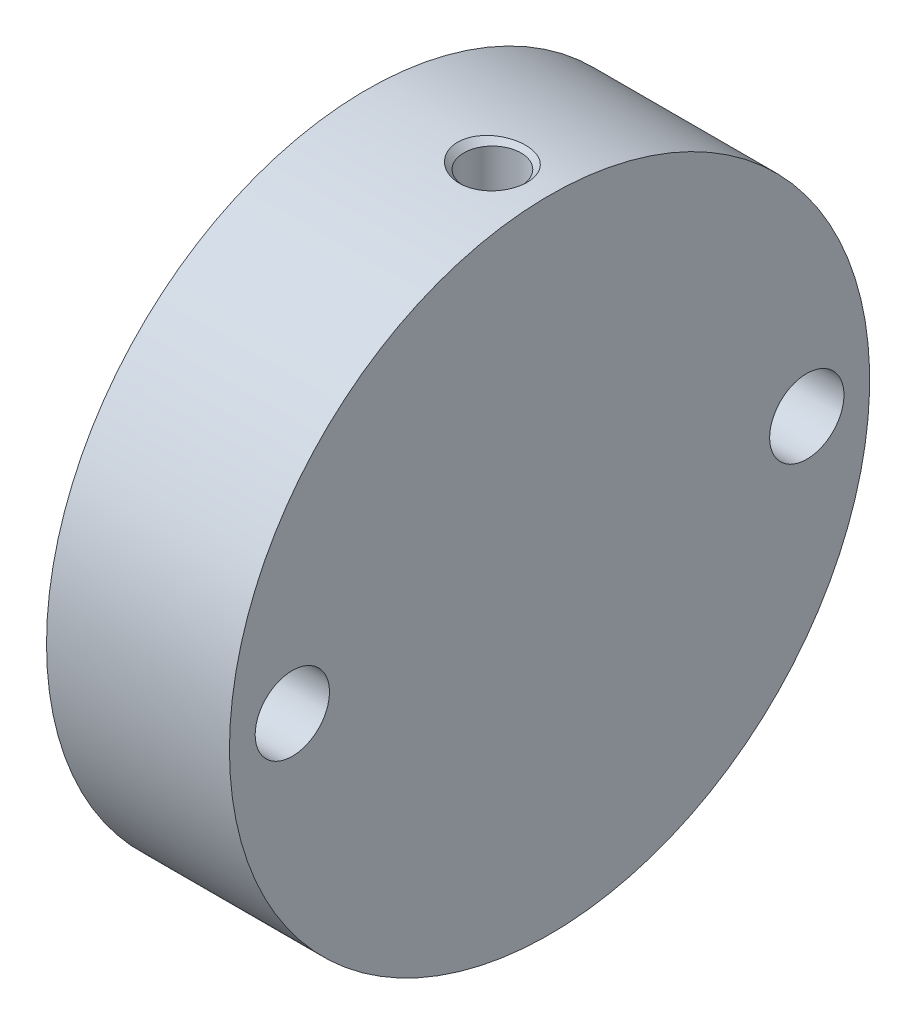
ISO-10303-21;
HEADER;
FILE_DESCRIPTION(('STEP AP214'),'2;1');
FILE_NAME('part.step','',(''),(''),'','','');
FILE_SCHEMA(('AUTOMOTIVE_DESIGN { 1 0 10303 214 1 1 1 1 }'));
ENDSEC;
DATA;
#1=APPLICATION_CONTEXT('core data for automotive mechanical design processes');
#2=APPLICATION_PROTOCOL_DEFINITION('international standard','automotive_design',2000,#1);
#3=PRODUCT_CONTEXT('',#1,'mechanical');
#4=PRODUCT('Part','Part','',(#3));
#5=PRODUCT_RELATED_PRODUCT_CATEGORY('part','',(#4));
#6=PRODUCT_DEFINITION_FORMATION('','',#4);
#7=PRODUCT_DEFINITION_CONTEXT('part definition',#1,'design');
#8=PRODUCT_DEFINITION('design','',#6,#7);
#9=PRODUCT_DEFINITION_SHAPE('','',#8);
#10=(LENGTH_UNIT() NAMED_UNIT(*) SI_UNIT(.MILLI.,.METRE.));
#11=(NAMED_UNIT(*) PLANE_ANGLE_UNIT() SI_UNIT($,.RADIAN.));
#12=(NAMED_UNIT(*) SI_UNIT($,.STERADIAN.) SOLID_ANGLE_UNIT());
#13=UNCERTAINTY_MEASURE_WITH_UNIT(LENGTH_MEASURE(1.E-05),#10,'distance_accuracy_value','');
#14=(GEOMETRIC_REPRESENTATION_CONTEXT(3) GLOBAL_UNCERTAINTY_ASSIGNED_CONTEXT((#13)) GLOBAL_UNIT_ASSIGNED_CONTEXT((#10,
#11,#12)) REPRESENTATION_CONTEXT('',''));
#15=CARTESIAN_POINT('',(0.,0.,0.));
#16=DIRECTION('',(0.,0.,1.));
#17=DIRECTION('',(1.,0.,0.));
#18=AXIS2_PLACEMENT_3D('',#15,#16,#17);
#19=CARTESIAN_POINT('',(9.69645,0.,0.));
#20=DIRECTION('',(1.,0.,0.));
#21=DIRECTION('',(0.,0.,-1.));
#22=AXIS2_PLACEMENT_3D('',#19,#20,#21);
#23=PLANE('',#22);
#24=CARTESIAN_POINT('',(9.69645,0.,0.));
#25=DIRECTION('',(-1.,0.,0.));
#26=DIRECTION('',(0.,0.,1.));
#27=AXIS2_PLACEMENT_3D('',#24,#25,#26);
#28=CIRCLE('',#27,9.652);
#29=CARTESIAN_POINT('',(9.69645,0.,9.652));
#30=VERTEX_POINT('',#29);
#31=EDGE_CURVE('E89',#30,#30,#28,.T.);
#32=ORIENTED_EDGE('',*,*,#31,.T.);
#33=EDGE_LOOP('',(#32));
#34=FACE_BOUND('',#33,.T.);
#35=ADVANCED_FACE('F15',(#34),#23,.F.);
#36=CARTESIAN_POINT('',(8.73125,8.89,0.));
#37=DIRECTION('',(0.,1.,0.));
#38=DIRECTION('',(0.,0.,1.));
#39=AXIS2_PLACEMENT_3D('',#36,#37,#38);
#40=CYLINDRICAL_SURFACE('',#39,0.482600000000003);
#41=CARTESIAN_POINT('',(8.73125,15.8523162872939,0.));
#42=DIRECTION('',(0.,1.,0.));
#43=DIRECTION('',(0.,0.,1.));
#44=AXIS2_PLACEMENT_3D('',#41,#42,#43);
#45=CIRCLE('',#44,0.482599999998001);
#46=CARTESIAN_POINT('',(8.73125,15.8523162872939,0.482599999998001));
#47=VERTEX_POINT('',#46);
#48=EDGE_CURVE('E88',#47,#47,#45,.T.);
#49=ORIENTED_EDGE('',*,*,#48,.T.);
#50=EDGE_LOOP('',(#49));
#51=FACE_BOUND('',#50,.T.);
#52=CARTESIAN_POINT('',(8.82691178443201,9.64040208793173,-0.473023871496162));
#53=CARTESIAN_POINT('',(8.853478600334,9.64066585059454,-0.467649923057808));
#54=CARTESIAN_POINT('',(8.8796096214966,9.64103593029908,-0.460029012636091));
#55=CARTESIAN_POINT('',(8.93024028657117,9.64194768011579,-0.440503654337834));
#56=CARTESIAN_POINT('',(8.95473795414603,9.64248955369429,-0.428594124895926));
#57=CARTESIAN_POINT('',(9.00137407481033,9.64368315618617,-0.400838334919282));
#58=CARTESIAN_POINT('',(9.02351372980269,9.64433482869233,-0.384994093801457));
#59=CARTESIAN_POINT('',(9.06481347513031,9.64567462311919,-0.349819725848855));
#60=CARTESIAN_POINT('',(9.08397428043544,9.64636273624027,-0.330490437891987));
#61=CARTESIAN_POINT('',(9.11879495043228,9.64769861674467,-0.288874160856062));
#62=CARTESIAN_POINT('',(9.13445215619088,9.64834635321842,-0.266584945747979));
#63=CARTESIAN_POINT('',(9.16180271790883,9.64952793776097,-0.219690541929899));
#64=CARTESIAN_POINT('',(9.17349593314582,9.65006178178631,-0.19508527103912));
#65=CARTESIAN_POINT('',(9.19258104141403,9.65095519425309,-0.144266598186337));
#66=CARTESIAN_POINT('',(9.19997448231819,9.6513148254015,-0.118053778685912));
#67=CARTESIAN_POINT('',(9.21025505155551,9.65181953742723,-0.064756972157018));
#68=CARTESIAN_POINT('',(9.21314222208857,9.65196462031371,-0.0376729932891269));
#69=CARTESIAN_POINT('',(9.21432695079284,9.65202383970858,0.0165652629517799));
#70=CARTESIAN_POINT('',(9.21262959300494,9.65193823204291,0.0437194291187682));
#71=CARTESIAN_POINT('',(9.20470472231245,9.65154625987542,0.0973566861254278));
#72=CARTESIAN_POINT('',(9.19847722176638,9.65123989597582,0.123839778795627));
#73=CARTESIAN_POINT('',(9.18167118470258,9.65044095201613,0.175379943345877));
#74=CARTESIAN_POINT('',(9.17109328549389,9.64994839923251,0.200437223487676));
#75=CARTESIAN_POINT('',(9.14588732778346,9.64883244512944,0.248421241435725));
#76=CARTESIAN_POINT('',(9.13125923608947,9.64820904273764,0.271347961779493));
#77=CARTESIAN_POINT('',(9.09835006336523,9.64690074287379,0.314445827438008));
#78=CARTESIAN_POINT('',(9.08006518175844,9.64621578183382,0.334614068777294));
#79=CARTESIAN_POINT('',(9.04036962709465,9.64486203080492,0.371596117569157));
#80=CARTESIAN_POINT('',(9.01895894240953,9.64419324087615,0.388409912542496));
#81=CARTESIAN_POINT('',(8.97360348514573,9.64294680470675,0.418215690297399));
#82=CARTESIAN_POINT('',(8.94965717483509,9.64236921430915,0.431205335662262));
#83=CARTESIAN_POINT('',(8.89992027573722,9.64137092897452,0.452979083595711));
#84=CARTESIAN_POINT('',(8.87412969673885,9.64095023320482,0.461763208484107));
#85=CARTESIAN_POINT('',(8.82145757958168,9.64031359044806,0.474869783709755));
#86=CARTESIAN_POINT('',(8.79457690633107,9.64009748432522,0.479195702002364));
#87=CARTESIAN_POINT('',(8.74047004823061,9.63989390627959,0.483274027071729));
#88=CARTESIAN_POINT('',(8.71324386562981,9.63990643286931,0.483026463603775));
#89=CARTESIAN_POINT('',(8.65924628820372,9.64015857563368,0.477967432445839));
#90=CARTESIAN_POINT('',(8.63247448477103,9.64039797542472,0.473160313494383));
#91=CARTESIAN_POINT('',(8.58011840734985,9.64107651496723,0.459125842914443));
#92=CARTESIAN_POINT('',(8.55453413646129,9.64151565524007,0.449898479748042));
#93=CARTESIAN_POINT('',(8.50526854812146,9.64254434485509,0.42728218137894));
#94=CARTESIAN_POINT('',(8.48158792137832,9.64313394846957,0.413891744169473));
#95=CARTESIAN_POINT('',(8.43680917385624,9.64439707371412,0.383330350999746));
#96=CARTESIAN_POINT('',(8.41571107227039,9.64507059596778,0.36615936694547));
#97=CARTESIAN_POINT('',(8.37667161768533,9.64642655087874,0.328501580331402));
#98=CARTESIAN_POINT('',(8.3587337979044,9.64710899260422,0.308011115062328));
#99=CARTESIAN_POINT('',(8.32655201238646,9.64840517149789,0.26430797715352));
#100=CARTESIAN_POINT('',(8.31230805104865,9.64901890858425,0.241095301271824));
#101=CARTESIAN_POINT('',(8.28791723673742,9.65010860120586,0.192602013322742));
#102=CARTESIAN_POINT('',(8.27777091061991,9.65058453902125,0.167321135837307));
#103=CARTESIAN_POINT('',(8.26186772200809,9.65134484805023,0.115411841744874));
#104=CARTESIAN_POINT('',(8.25611082307998,9.65162922085389,0.0887834363247943));
#105=CARTESIAN_POINT('',(8.24915494399501,9.65197413025986,0.0349649540769365));
#106=CARTESIAN_POINT('',(8.24795117102673,9.65203490223197,0.00777549817504966));
#107=CARTESIAN_POINT('',(8.25012273719345,9.65192641783152,-0.0464194303550292));
#108=CARTESIAN_POINT('',(8.2534980665029,9.65175716195254,-0.0734249033778749));
#109=CARTESIAN_POINT('',(8.26472784491088,9.65120785676751,-0.126468783044584));
#110=CARTESIAN_POINT('',(8.27257963925145,9.65082793240161,-0.152507753131129));
#111=CARTESIAN_POINT('',(8.29253654783662,9.64990010225596,-0.202898116718834));
#112=CARTESIAN_POINT('',(8.30464169314435,9.6493521952494,-0.22724949789362));
#113=CARTESIAN_POINT('',(8.33277300103818,9.64814947525204,-0.273595067428044));
#114=CARTESIAN_POINT('',(8.3488023286792,9.64749457610912,-0.295587332343971));
#115=CARTESIAN_POINT('',(8.38432221281501,9.64615187862034,-0.336569673889902));
#116=CARTESIAN_POINT('',(8.40381265955754,9.64546408131818,-0.355559845680353));
#117=CARTESIAN_POINT('',(8.44572157523306,9.64413238906976,-0.390016449041162));
#118=CARTESIAN_POINT('',(8.46814248704221,9.64348853144149,-0.405479910843984));
#119=CARTESIAN_POINT('',(8.5152713392436,9.64231786918307,-0.432426693819606));
#120=CARTESIAN_POINT('',(8.53997982756004,9.64179109269966,-0.443909058291997));
#121=CARTESIAN_POINT('',(8.59097699729467,9.64091426305894,-0.462562211567225));
#122=CARTESIAN_POINT('',(8.61726582318488,9.64056422608644,-0.469732605515006));
#123=CARTESIAN_POINT('',(8.67065502584937,9.64008106503623,-0.479547733988183));
#124=CARTESIAN_POINT('',(8.69775440251679,9.63994768403647,-0.482197829108715));
#125=CARTESIAN_POINT('',(8.74198280371538,9.63991812368235,-0.482785022734862));
#126=CARTESIAN_POINT('',(8.75910520366269,9.63995263632657,-0.482099222662507));
#127=CARTESIAN_POINT('',(8.79318027400602,9.64011132604314,-0.478915661717446));
#128=CARTESIAN_POINT('',(8.81013294463839,9.64023550299062,-0.476417903368066));
#129=CARTESIAN_POINT('',(8.82691178443201,9.64040208793173,-0.473023871496162));
#130=B_SPLINE_CURVE_WITH_KNOTS('',3,(#52,#53,#54,#55,#56,#57,#58,#59,#60,#61,#62,#63,#64,#65,
#66,#67,#68,#69,#70,#71,#72,#73,#74,#75,#76,#77,#78,#79,#80,#81,#82,#83,#84,#85,#86,#87,#88,#89,
#90,#91,#92,#93,#94,#95,#96,#97,#98,#99,#100,#101,#102,#103,#104,#105,#106,#107,#108,#109,#110,
#111,#112,#113,#114,#115,#116,#117,#118,#119,#120,#121,#122,#123,#124,#125,#126,#127,#128,#129),
.UNSPECIFIED.,.T.,.F.,(4,2,2,2,2,2,2,2,2,2,2,2,2,2,2,2,2,2,2,2,2,2,2,2,2,2,2,2,2,2,2,2,2,2,2,2,
2,2,4),(0.,0.0812559962180522,0.162608590826617,0.24391951872121,0.325210900508895,
0.406563767849222,0.487919522928426,0.569245972644902,0.650571660758367,0.731807199288603,
0.813042516203921,0.89426593683702,0.97549002313434,1.05679897014646,1.13810821963909,
1.21946706470236,1.30082547796794,1.38212055616991,1.46341510546241,1.54463219684813,
1.62584950023147,1.70709614029781,1.78834338414492,1.86968089440943,1.95101850154216,
2.03236656337952,2.11371394999167,2.19497568306213,2.27623724176666,2.3574506585341,
2.43866466843266,2.51994439866969,2.60122155198234,2.6825668964131,2.76393177547603,
2.8453041041362,2.9265798665781,2.97789889729985,3.02921785655503),.UNSPECIFIED.);
#131=CARTESIAN_POINT('',(8.82691178443201,9.64040208793173,-0.473023871496162));
#132=VERTEX_POINT('',#131);
#133=EDGE_CURVE('E18',#132,#132,#130,.T.);
#134=ORIENTED_EDGE('',*,*,#133,.T.);
#135=EDGE_LOOP('',(#134));
#136=FACE_BOUND('',#135,.T.);
#137=ADVANCED_FACE('F97',(#51,#136),#40,.F.);
#138=CARTESIAN_POINT('',(12.7,0.,0.));
#139=DIRECTION('',(-1.,0.,0.));
#140=DIRECTION('',(0.,0.,1.));
#141=AXIS2_PLACEMENT_3D('',#138,#139,#140);
#142=CYLINDRICAL_SURFACE('',#141,9.652);
#143=ORIENTED_EDGE('',*,*,#31,.F.);
#144=EDGE_LOOP('',(#143));
#145=FACE_BOUND('',#144,.T.);
#146=ORIENTED_EDGE('',*,*,#133,.F.);
#147=EDGE_LOOP('',(#146));
#148=FACE_BOUND('',#147,.T.);
#149=CARTESIAN_POINT('',(7.76605,0.,0.));
#150=DIRECTION('',(-1.,0.,0.));
#151=DIRECTION('',(0.,0.,1.));
#152=AXIS2_PLACEMENT_3D('',#149,#150,#151);
#153=CIRCLE('',#152,9.652);
#154=CARTESIAN_POINT('',(7.76605,0.,9.652));
#155=VERTEX_POINT('',#154);
#156=EDGE_CURVE('E86',#155,#155,#153,.T.);
#157=ORIENTED_EDGE('',*,*,#156,.T.);
#158=EDGE_LOOP('',(#157));
#159=FACE_BOUND('',#158,.T.);
#160=ADVANCED_FACE('F99',(#145,#148,#159),#142,.F.);
#161=CARTESIAN_POINT('',(8.73125,16.7189998703634,0.));
#162=DIRECTION('',(0.,1.,0.));
#163=DIRECTION('',(0.,0.,1.));
#164=AXIS2_PLACEMENT_3D('',#161,#162,#163);
#165=CONICAL_SURFACE('',#164,1.98373999995738,1.04719755119577);
#166=CARTESIAN_POINT('',(8.73125,16.718999870343,0.));
#167=DIRECTION('',(0.,1.,0.));
#168=DIRECTION('',(0.,0.,1.));
#169=AXIS2_PLACEMENT_3D('',#166,#167,#168);
#170=CIRCLE('',#169,1.98374);
#171=CARTESIAN_POINT('',(8.73125,16.718999870343,1.98374));
#172=VERTEX_POINT('',#171);
#173=EDGE_CURVE('E85',#172,#172,#170,.T.);
#174=ORIENTED_EDGE('',*,*,#173,.T.);
#175=EDGE_LOOP('',(#174));
#176=FACE_BOUND('',#175,.T.);
#177=ORIENTED_EDGE('',*,*,#48,.F.);
#178=EDGE_LOOP('',(#177));
#179=FACE_BOUND('',#178,.T.);
#180=ADVANCED_FACE('F102',(#176,#179),#165,.F.);
#181=CARTESIAN_POINT('',(7.76605,9.652,0.));
#182=DIRECTION('',(1.,0.,0.));
#183=DIRECTION('',(0.,0.,-1.));
#184=AXIS2_PLACEMENT_3D('',#181,#182,#183);
#185=PLANE('',#184);
#186=ORIENTED_EDGE('',*,*,#156,.F.);
#187=EDGE_LOOP('',(#186));
#188=FACE_BOUND('',#187,.T.);
#189=CARTESIAN_POINT('',(7.76605,0.,0.));
#190=DIRECTION('',(-1.,0.,0.));
#191=DIRECTION('',(0.,0.,1.));
#192=AXIS2_PLACEMENT_3D('',#189,#190,#191);
#193=CIRCLE('',#192,12.7);
#194=CARTESIAN_POINT('',(7.76605,0.,12.7));
#195=VERTEX_POINT('',#194);
#196=EDGE_CURVE('E82',#195,#195,#193,.T.);
#197=ORIENTED_EDGE('',*,*,#196,.T.);
#198=EDGE_LOOP('',(#197));
#199=FACE_BOUND('',#198,.T.);
#200=ADVANCED_FACE('F106',(#188,#199),#185,.F.);
#201=CARTESIAN_POINT('',(8.73125,8.89,0.));
#202=DIRECTION('',(0.,1.,0.));
#203=DIRECTION('',(0.,0.,1.));
#204=AXIS2_PLACEMENT_3D('',#201,#202,#203);
#205=CYLINDRICAL_SURFACE('',#204,1.98374);
#206=CARTESIAN_POINT('',(8.73125,21.7957399999591,0.));
#207=DIRECTION('',(0.,1.,0.));
#208=DIRECTION('',(0.,0.,1.));
#209=AXIS2_PLACEMENT_3D('',#206,#207,#208);
#210=CIRCLE('',#209,1.98374000001422);
#211=CARTESIAN_POINT('',(8.73125,21.7957399999591,1.98374000001422));
#212=VERTEX_POINT('',#211);
#213=EDGE_CURVE('E70',#212,#212,#210,.T.);
#214=ORIENTED_EDGE('',*,*,#213,.T.);
#215=EDGE_LOOP('',(#214));
#216=FACE_BOUND('',#215,.T.);
#217=ORIENTED_EDGE('',*,*,#173,.F.);
#218=EDGE_LOOP('',(#217));
#219=FACE_BOUND('',#218,.T.);
#220=ADVANCED_FACE('F109',(#216,#219),#205,.F.);
#221=CARTESIAN_POINT('',(12.7,0.,-17.859375));
#222=DIRECTION('',(-1.,0.,0.));
#223=DIRECTION('',(0.,0.,1.));
#224=AXIS2_PLACEMENT_3D('',#221,#222,#223);
#225=CYLINDRICAL_SURFACE('',#224,2.5796875);
#226=CARTESIAN_POINT('',(0.,0.,-17.859375));
#227=DIRECTION('',(-1.,0.,0.));
#228=DIRECTION('',(0.,0.,1.));
#229=AXIS2_PLACEMENT_3D('',#226,#227,#228);
#230=CIRCLE('',#229,2.5796875);
#231=CARTESIAN_POINT('',(0.,0.,-15.2796875));
#232=VERTEX_POINT('',#231);
#233=EDGE_CURVE('E68',#232,#232,#230,.T.);
#234=ORIENTED_EDGE('',*,*,#233,.T.);
#235=EDGE_LOOP('',(#234));
#236=FACE_BOUND('',#235,.T.);
#237=CARTESIAN_POINT('',(12.7,0.,-17.859375));
#238=DIRECTION('',(-1.,0.,0.));
#239=DIRECTION('',(0.,0.,1.));
#240=AXIS2_PLACEMENT_3D('',#237,#238,#239);
#241=CIRCLE('',#240,2.5796875);
#242=CARTESIAN_POINT('',(12.7,0.,-15.2796875));
#243=VERTEX_POINT('',#242);
#244=EDGE_CURVE('E79',#243,#243,#241,.F.);
#245=ORIENTED_EDGE('',*,*,#244,.T.);
#246=EDGE_LOOP('',(#245));
#247=FACE_BOUND('',#246,.T.);
#248=ADVANCED_FACE('F117',(#236,#247),#225,.F.);
#249=CARTESIAN_POINT('',(12.7,0.,0.));
#250=DIRECTION('',(-1.,0.,0.));
#251=DIRECTION('',(0.,0.,1.));
#252=AXIS2_PLACEMENT_3D('',#249,#250,#251);
#253=CYLINDRICAL_SURFACE('',#252,12.7);
#254=ORIENTED_EDGE('',*,*,#196,.F.);
#255=EDGE_LOOP('',(#254));
#256=FACE_BOUND('',#255,.T.);
#257=CARTESIAN_POINT('',(0.,0.,0.));
#258=DIRECTION('',(-1.,0.,0.));
#259=DIRECTION('',(0.,0.,1.));
#260=AXIS2_PLACEMENT_3D('',#257,#258,#259);
#261=CIRCLE('',#260,12.7);
#262=CARTESIAN_POINT('',(0.,0.,12.7));
#263=VERTEX_POINT('',#262);
#264=EDGE_CURVE('E64',#263,#263,#261,.T.);
#265=ORIENTED_EDGE('',*,*,#264,.T.);
#266=EDGE_LOOP('',(#265));
#267=FACE_BOUND('',#266,.T.);
#268=ADVANCED_FACE('F113',(#256,#267),#253,.F.);
#269=CARTESIAN_POINT('',(12.7,0.,17.859375));
#270=DIRECTION('',(-1.,0.,0.));
#271=DIRECTION('',(0.,0.,1.));
#272=AXIS2_PLACEMENT_3D('',#269,#270,#271);
#273=CYLINDRICAL_SURFACE('',#272,2.5796875);
#274=CARTESIAN_POINT('',(0.,0.,17.859375));
#275=DIRECTION('',(-1.,0.,0.));
#276=DIRECTION('',(0.,0.,1.));
#277=AXIS2_PLACEMENT_3D('',#274,#275,#276);
#278=CIRCLE('',#277,2.5796875);
#279=CARTESIAN_POINT('',(0.,0.,20.4390625));
#280=VERTEX_POINT('',#279);
#281=EDGE_CURVE('E60',#280,#280,#278,.T.);
#282=ORIENTED_EDGE('',*,*,#281,.T.);
#283=EDGE_LOOP('',(#282));
#284=FACE_BOUND('',#283,.T.);
#285=CARTESIAN_POINT('',(12.7,0.,17.859375));
#286=DIRECTION('',(-1.,0.,0.));
#287=DIRECTION('',(0.,0.,1.));
#288=AXIS2_PLACEMENT_3D('',#285,#286,#287);
#289=CIRCLE('',#288,2.5796875);
#290=CARTESIAN_POINT('',(12.7,0.,20.4390625));
#291=VERTEX_POINT('',#290);
#292=EDGE_CURVE('E74',#291,#291,#289,.F.);
#293=ORIENTED_EDGE('',*,*,#292,.T.);
#294=EDGE_LOOP('',(#293));
#295=FACE_BOUND('',#294,.T.);
#296=ADVANCED_FACE('F116',(#284,#295),#273,.F.);
#297=CARTESIAN_POINT('',(12.7,22.225,0.));
#298=DIRECTION('',(-1.,0.,0.));
#299=DIRECTION('',(0.,0.,1.));
#300=AXIS2_PLACEMENT_3D('',#297,#298,#299);
#301=PLANE('',#300);
#302=ORIENTED_EDGE('',*,*,#292,.F.);
#303=EDGE_LOOP('',(#302));
#304=FACE_BOUND('',#303,.T.);
#305=CARTESIAN_POINT('',(12.7,0.,0.));
#306=DIRECTION('',(-1.,0.,0.));
#307=DIRECTION('',(0.,0.,1.));
#308=AXIS2_PLACEMENT_3D('',#305,#306,#307);
#309=CIRCLE('',#308,22.225);
#310=CARTESIAN_POINT('',(12.7,0.,22.225));
#311=VERTEX_POINT('',#310);
#312=EDGE_CURVE('E30',#311,#311,#309,.T.);
#313=ORIENTED_EDGE('',*,*,#312,.F.);
#314=EDGE_LOOP('',(#313));
#315=FACE_BOUND('',#314,.T.);
#316=ORIENTED_EDGE('',*,*,#244,.F.);
#317=EDGE_LOOP('',(#316));
#318=FACE_BOUND('',#317,.T.);
#319=ADVANCED_FACE('F55',(#304,#315,#318),#301,.F.);
#320=CARTESIAN_POINT('',(8.73125,22.228737508442,0.));
#321=DIRECTION('',(0.,1.,0.));
#322=DIRECTION('',(0.,0.,1.));
#323=AXIS2_PLACEMENT_3D('',#320,#321,#322);
#324=CONICAL_SURFACE('',#323,2.41673750844029,0.785398163397448);
#325=CARTESIAN_POINT('',(7.15462225329661,22.1570960335492,-1.7360070148359));
#326=CARTESIAN_POINT('',(7.24415584766211,22.1513353037464,-1.80953583813628));
#327=CARTESIAN_POINT('',(7.33907359989376,22.1457167553167,-1.87655787540342));
#328=CARTESIAN_POINT('',(7.53754948260799,22.1352285776781,-1.99647458446397));
#329=CARTESIAN_POINT('',(7.64111500591772,22.1303595995861,-2.04935700287707));
#330=CARTESIAN_POINT('',(7.87377603511009,22.1210005164319,-2.14822591038227));
#331=CARTESIAN_POINT('',(8.00412978440298,22.1167329968442,-2.19129871423284));
#332=CARTESIAN_POINT('',(8.27016781238927,22.1102586779155,-2.25568986453902));
#333=CARTESIAN_POINT('',(8.40585409651737,22.1080526617344,-2.27699994367586));
#334=CARTESIAN_POINT('',(8.68256843645748,22.1059117429191,-2.29769700682228));
#335=CARTESIAN_POINT('',(8.82364236858751,22.1060390762276,-2.29648321532323));
#336=CARTESIAN_POINT('',(9.10361402019897,22.1087047296824,-2.27067456504581));
#337=CARTESIAN_POINT('',(9.24251168025453,22.1112431155493,-2.24607906892744));
#338=CARTESIAN_POINT('',(9.51503417500235,22.1184651615253,-2.17380845024177));
#339=CARTESIAN_POINT('',(9.64862169461773,22.1231618080311,-2.1259935145001));
#340=CARTESIAN_POINT('',(9.90563668099411,22.1341574281461,-2.00827716391985));
#341=CARTESIAN_POINT('',(10.0290643599968,22.1404563682716,-1.93837621061151));
#342=CARTESIAN_POINT('',(10.2597237059737,22.153779157893,-1.77958048839399));
#343=CARTESIAN_POINT('',(10.367207392315,22.160787879129,-1.69105113823824));
#344=CARTESIAN_POINT('',(10.5649557330795,22.174776036285,-1.49646707041677));
#345=CARTESIAN_POINT('',(10.6552244976728,22.1817554788054,-1.39041654735411));
#346=CARTESIAN_POINT('',(10.8118065935631,22.1945282700053,-1.1684826285224));
#347=CARTESIAN_POINT('',(10.8789672742126,22.2003591395649,-1.05319980779705));
#348=CARTESIAN_POINT('',(10.9918088357089,22.210469189132,-0.81249770193697));
#349=CARTESIAN_POINT('',(11.0374975111815,22.2147489320899,-0.687082114537823));
#350=CARTESIAN_POINT('',(11.1037466573351,22.2210450130727,-0.436643822727927));
#351=CARTESIAN_POINT('',(11.1254797959655,22.2231665425844,-0.311933360859632));
#352=CARTESIAN_POINT('',(11.1470523728844,22.2252721354131,-0.0606241463042416));
#353=CARTESIAN_POINT('',(11.1468966389263,22.2252566700601,0.0659741838403644));
#354=CARTESIAN_POINT('',(11.1250569094911,22.2231255178852,0.313281795827487));
#355=CARTESIAN_POINT('',(11.1040437159434,22.2210752724045,0.434051676097615));
#356=CARTESIAN_POINT('',(11.0422847316277,22.2152019853024,0.670377352301524));
#357=CARTESIAN_POINT('',(11.0015387479966,22.2113789263542,0.785933097261675));
#358=CARTESIAN_POINT('',(10.9013322212792,22.2023355100129,1.00974816004197));
#359=CARTESIAN_POINT('',(10.8417125093128,22.1971033271558,1.117935543787));
#360=CARTESIAN_POINT('',(10.7058614759066,22.1858107937566,1.32325968552982));
#361=CARTESIAN_POINT('',(10.6296273136421,22.1797503016519,1.42039454938194));
#362=CARTESIAN_POINT('',(10.4594129640261,22.1671594827637,1.60518105318914));
#363=CARTESIAN_POINT('',(10.3648315506114,22.1606200848179,1.69227787703963));
#364=CARTESIAN_POINT('',(10.1629604403147,22.1479901602713,1.85025767857852));
#365=CARTESIAN_POINT('',(10.0556678157521,22.1418997376059,1.92113690992481));
#366=CARTESIAN_POINT('',(9.82570315875915,22.1305041872632,2.04834188805733));
#367=CARTESIAN_POINT('',(9.70253219970353,22.1252530127141,2.10377111132669));
#368=CARTESIAN_POINT('',(9.44880921240714,22.1164829388404,2.19405392072512));
#369=CARTESIAN_POINT('',(9.31825575840609,22.1129643754126,2.22890351739593));
#370=CARTESIAN_POINT('',(9.04842445935354,22.1079410940254,2.27820433298386));
#371=CARTESIAN_POINT('',(8.90900180892291,22.1065136825192,2.29187353986964));
#372=CARTESIAN_POINT('',(8.62979631917532,22.1060768166758,2.29608258089984));
#373=CARTESIAN_POINT('',(8.4900134406653,22.107067637588,2.28661978210071));
#374=CARTESIAN_POINT('',(8.21207006534999,22.1113868545491,2.24447085477789));
#375=CARTESIAN_POINT('',(8.07395744662728,22.1147468410816,2.21147081092107));
#376=CARTESIAN_POINT('',(7.80533832177927,22.1234516725365,2.1226141310381));
#377=CARTESIAN_POINT('',(7.67483191583513,22.1287965435949,2.06675719404236));
#378=CARTESIAN_POINT('',(7.4266579581998,22.1407808062088,1.93412046978646));
#379=CARTESIAN_POINT('',(7.30887447325474,22.1474066364255,1.85755678067996));
#380=CARTESIAN_POINT('',(7.08845885104145,22.1611957684879,1.68507683640603));
#381=CARTESIAN_POINT('',(6.98582422644796,22.1683589818077,1.58916376439161));
#382=CARTESIAN_POINT('',(6.8026022022419,22.1820865683304,1.38413311457742));
#383=CARTESIAN_POINT('',(6.72137083647571,22.1886631130467,1.27559256627472));
#384=CARTESIAN_POINT('',(6.57942705006514,22.2006798730353,1.04577110710104));
#385=CARTESIAN_POINT('',(6.51870747482652,22.2061204842723,0.924494657951729));
#386=CARTESIAN_POINT('',(6.42278407746171,22.2149360234567,0.679338548413044));
#387=CARTESIAN_POINT('',(6.38643103363982,22.2184026075398,0.555911640544705));
#388=CARTESIAN_POINT('',(6.33586700202324,22.2232677787531,0.304572697186648));
#389=CARTESIAN_POINT('',(6.32164913774025,22.2246670081182,0.176662067236076));
#390=CARTESIAN_POINT('',(6.31604916834287,22.2252156398506,-0.0743932626422654));
#391=CARTESIAN_POINT('',(6.32375485561,22.2244549174253,-0.197518389724077));
#392=CARTESIAN_POINT('',(6.35975454394003,22.2209630666924,-0.440698045298348));
#393=CARTESIAN_POINT('',(6.38804995272201,22.2182318036591,-0.56075236325863));
#394=CARTESIAN_POINT('',(6.46399138002594,22.2111212321764,-0.793902170857863));
#395=CARTESIAN_POINT('',(6.51155101631169,22.2067492870194,-0.907026163248929));
#396=CARTESIAN_POINT('',(6.62435130283216,22.1968271110946,-1.12395957376312));
#397=CARTESIAN_POINT('',(6.68958352423169,22.1912774423078,-1.22777340097754));
#398=CARTESIAN_POINT('',(6.81927163519265,22.1808818816507,-1.40175979230006));
#399=CARTESIAN_POINT('',(6.88064483642892,22.1761557702385,-1.47426647726106));
#400=CARTESIAN_POINT('',(7.01168562790705,22.1666200278844,-1.6113022743462));
#401=CARTESIAN_POINT('',(7.08135099313983,22.1618104196415,-1.67583351706398));
#402=CARTESIAN_POINT('',(7.15462225329661,22.1570960335492,-1.7360070148359));
#403=B_SPLINE_CURVE_WITH_KNOTS('',3,(#325,#326,#327,#328,#329,#330,#331,#332,#333,#334,#335,
#336,#337,#338,#339,#340,#341,#342,#343,#344,#345,#346,#347,#348,#349,#350,#351,#352,#353,#354,
#355,#356,#357,#358,#359,#360,#361,#362,#363,#364,#365,#366,#367,#368,#369,#370,#371,#372,#373,
#374,#375,#376,#377,#378,#379,#380,#381,#382,#383,#384,#385,#386,#387,#388,#389,#390,#391,#392,
#393,#394,#395,#396,#397,#398,#399,#400,#401,#402),.UNSPECIFIED.,.T.,.F.,(4,2,2,2,2,2,2,2,2,2,2,
2,2,2,2,2,2,2,2,2,2,2,2,2,2,2,2,2,2,2,2,2,2,2,2,2,2,2,4),(0.,0.347742911423464,
0.695786206921335,1.10592564037404,1.51622082149135,1.9374751027849,2.35874086698409,
2.78257529179264,3.20640086034334,3.62258018933033,4.03866002816257,4.43725294269748,
4.8357010506791,5.21363409140176,5.59148377631889,5.95756264583539,6.32364509338093,
6.69290099761878,7.06222008874818,7.44673879023912,7.83134622792722,8.23503547628148,
8.63880295604382,9.05715021701191,9.47554509754313,9.89962702020231,10.323714527167,
10.743536457149,11.163289378765,11.5684062322474,11.9733816330999,12.3575805641051,
12.7416601164981,13.1099952125583,13.4783554940523,13.8450819899565,14.2116338848095,
14.496291111379,14.7808721282717),.UNSPECIFIED.);
#404=CARTESIAN_POINT('',(7.15462225329661,22.1570960335492,-1.7360070148359));
#405=VERTEX_POINT('',#404);
#406=EDGE_CURVE('E25',#405,#405,#403,.T.);
#407=ORIENTED_EDGE('',*,*,#406,.F.);
#408=EDGE_LOOP('',(#407));
#409=FACE_BOUND('',#408,.T.);
#410=ORIENTED_EDGE('',*,*,#213,.F.);
#411=EDGE_LOOP('',(#410));
#412=FACE_BOUND('',#411,.T.);
#413=ADVANCED_FACE('F41',(#409,#412),#324,.F.);
#414=CARTESIAN_POINT('',(0.,12.7,0.));
#415=DIRECTION('',(1.,0.,0.));
#416=DIRECTION('',(0.,0.,-1.));
#417=AXIS2_PLACEMENT_3D('',#414,#415,#416);
#418=PLANE('',#417);
#419=ORIENTED_EDGE('',*,*,#281,.F.);
#420=EDGE_LOOP('',(#419));
#421=FACE_BOUND('',#420,.T.);
#422=ORIENTED_EDGE('',*,*,#264,.F.);
#423=EDGE_LOOP('',(#422));
#424=FACE_BOUND('',#423,.T.);
#425=ORIENTED_EDGE('',*,*,#233,.F.);
#426=EDGE_LOOP('',(#425));
#427=FACE_BOUND('',#426,.T.);
#428=CARTESIAN_POINT('',(0.,0.,0.));
#429=DIRECTION('',(-1.,0.,0.));
#430=DIRECTION('',(0.,0.,1.));
#431=AXIS2_PLACEMENT_3D('',#428,#429,#430);
#432=CIRCLE('',#431,22.225);
#433=CARTESIAN_POINT('',(0.,0.,22.225));
#434=VERTEX_POINT('',#433);
#435=EDGE_CURVE('E10',#434,#434,#432,.F.);
#436=ORIENTED_EDGE('',*,*,#435,.F.);
#437=EDGE_LOOP('',(#436));
#438=FACE_BOUND('',#437,.T.);
#439=ADVANCED_FACE('F48',(#421,#424,#427,#438),#418,.F.);
#440=CARTESIAN_POINT('',(12.7,0.,0.));
#441=DIRECTION('',(-1.,0.,0.));
#442=DIRECTION('',(0.,0.,1.));
#443=AXIS2_PLACEMENT_3D('',#440,#441,#442);
#444=CYLINDRICAL_SURFACE('',#443,22.225);
#445=ORIENTED_EDGE('',*,*,#435,.T.);
#446=EDGE_LOOP('',(#445));
#447=FACE_BOUND('',#446,.T.);
#448=ORIENTED_EDGE('',*,*,#406,.T.);
#449=EDGE_LOOP('',(#448));
#450=FACE_BOUND('',#449,.T.);
#451=ORIENTED_EDGE('',*,*,#312,.T.);
#452=EDGE_LOOP('',(#451));
#453=FACE_BOUND('',#452,.T.);
#454=ADVANCED_FACE('F45',(#447,#450,#453),#444,.T.);
#455=CLOSED_SHELL('',(#35,#137,#160,#180,#200,#220,#248,#268,#296,#319,#413,#439,#454));
#456=MANIFOLD_SOLID_BREP('B1',#455);
#457=ADVANCED_BREP_SHAPE_REPRESENTATION('',(#18,#456),#14);
#458=SHAPE_DEFINITION_REPRESENTATION(#9,#457);
ENDSEC;
END-ISO-10303-21;
